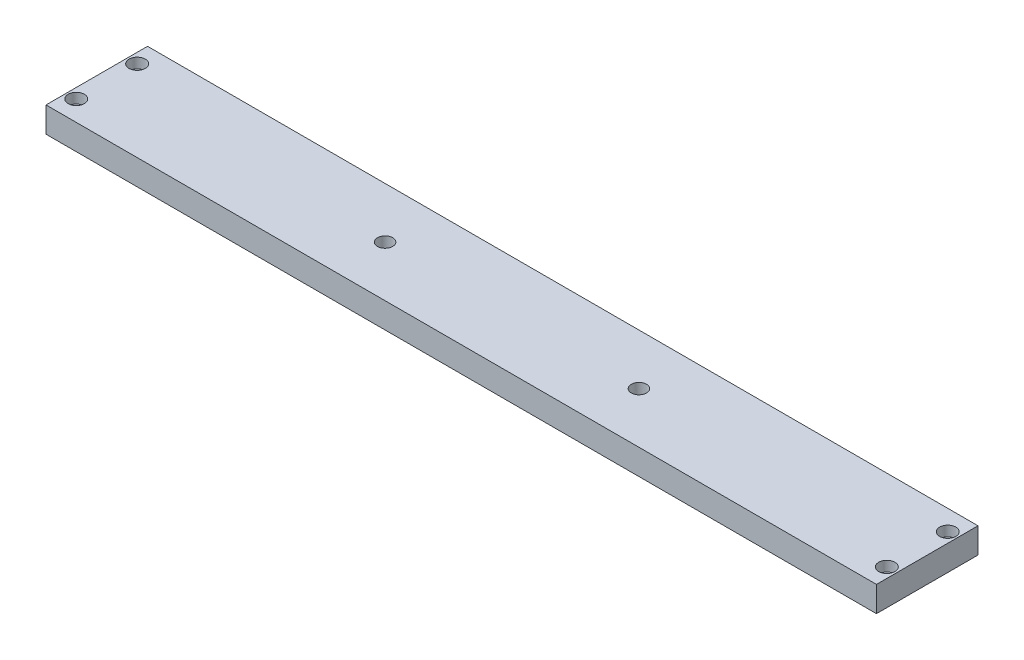
ISO-10303-21;
HEADER;
FILE_DESCRIPTION(('STEP AP214'),'2;1');
FILE_NAME('part.step','',(''),(''),'','','');
FILE_SCHEMA(('AUTOMOTIVE_DESIGN { 1 0 10303 214 1 1 1 1 }'));
ENDSEC;
DATA;
#1=APPLICATION_CONTEXT('core data for automotive mechanical design processes');
#2=APPLICATION_PROTOCOL_DEFINITION('international standard','automotive_design',2000,#1);
#3=PRODUCT_CONTEXT('',#1,'mechanical');
#4=PRODUCT('Part','Part','',(#3));
#5=PRODUCT_RELATED_PRODUCT_CATEGORY('part','',(#4));
#6=PRODUCT_DEFINITION_FORMATION('','',#4);
#7=PRODUCT_DEFINITION_CONTEXT('part definition',#1,'design');
#8=PRODUCT_DEFINITION('design','',#6,#7);
#9=PRODUCT_DEFINITION_SHAPE('','',#8);
#10=(LENGTH_UNIT() NAMED_UNIT(*) SI_UNIT(.MILLI.,.METRE.));
#11=(NAMED_UNIT(*) PLANE_ANGLE_UNIT() SI_UNIT($,.RADIAN.));
#12=(NAMED_UNIT(*) SI_UNIT($,.STERADIAN.) SOLID_ANGLE_UNIT());
#13=UNCERTAINTY_MEASURE_WITH_UNIT(LENGTH_MEASURE(1.E-05),#10,'distance_accuracy_value','');
#14=(GEOMETRIC_REPRESENTATION_CONTEXT(3) GLOBAL_UNCERTAINTY_ASSIGNED_CONTEXT((#13)) GLOBAL_UNIT_ASSIGNED_CONTEXT((#10,
#11,#12)) REPRESENTATION_CONTEXT('',''));
#15=CARTESIAN_POINT('',(0.,0.,0.));
#16=DIRECTION('',(0.,0.,1.));
#17=DIRECTION('',(1.,0.,0.));
#18=AXIS2_PLACEMENT_3D('',#15,#16,#17);
#19=CARTESIAN_POINT('',(-79.825,5.,-6.));
#20=DIRECTION('',(0.,-1.,0.));
#21=DIRECTION('',(0.,0.,-1.));
#22=AXIS2_PLACEMENT_3D('',#19,#20,#21);
#23=CYLINDRICAL_SURFACE('',#22,0.999999999999998);
#24=CARTESIAN_POINT('',(-79.825,0.,-6.));
#25=DIRECTION('',(0.,1.,0.));
#26=DIRECTION('',(0.,0.,1.));
#27=AXIS2_PLACEMENT_3D('',#24,#25,#26);
#28=CIRCLE('',#27,0.999999999999998);
#29=CARTESIAN_POINT('',(-79.825,0.,-5.));
#30=VERTEX_POINT('',#29);
#31=EDGE_CURVE('E104',#30,#30,#28,.T.);
#32=ORIENTED_EDGE('',*,*,#31,.F.);
#33=EDGE_LOOP('',(#32));
#34=FACE_BOUND('',#33,.T.);
#35=CARTESIAN_POINT('',(-79.825,3.,-6.));
#36=DIRECTION('',(0.,1.,0.));
#37=DIRECTION('',(0.,0.,1.));
#38=AXIS2_PLACEMENT_3D('',#35,#36,#37);
#39=CIRCLE('',#38,0.999999999999998);
#40=CARTESIAN_POINT('',(-79.825,3.,-5.));
#41=VERTEX_POINT('',#40);
#42=EDGE_CURVE('E120',#41,#41,#39,.T.);
#43=ORIENTED_EDGE('',*,*,#42,.T.);
#44=EDGE_LOOP('',(#43));
#45=FACE_BOUND('',#44,.T.);
#46=ADVANCED_FACE('F34',(#34,#45),#23,.F.);
#47=CARTESIAN_POINT('',(-79.825,5.,6.));
#48=DIRECTION('',(0.,-1.,0.));
#49=DIRECTION('',(0.,0.,-1.));
#50=AXIS2_PLACEMENT_3D('',#47,#48,#49);
#51=CYLINDRICAL_SURFACE('',#50,0.999999999999998);
#52=CARTESIAN_POINT('',(-79.825,0.,6.));
#53=DIRECTION('',(0.,1.,0.));
#54=DIRECTION('',(0.,0.,1.));
#55=AXIS2_PLACEMENT_3D('',#52,#53,#54);
#56=CIRCLE('',#55,0.999999999999998);
#57=CARTESIAN_POINT('',(-79.825,0.,7.));
#58=VERTEX_POINT('',#57);
#59=EDGE_CURVE('E165',#58,#58,#56,.T.);
#60=ORIENTED_EDGE('',*,*,#59,.F.);
#61=EDGE_LOOP('',(#60));
#62=FACE_BOUND('',#61,.T.);
#63=CARTESIAN_POINT('',(-79.825,3.,6.));
#64=DIRECTION('',(0.,1.,0.));
#65=DIRECTION('',(0.,0.,1.));
#66=AXIS2_PLACEMENT_3D('',#63,#64,#65);
#67=CIRCLE('',#66,0.999999999999998);
#68=CARTESIAN_POINT('',(-79.825,3.,7.));
#69=VERTEX_POINT('',#68);
#70=EDGE_CURVE('E117',#69,#69,#67,.T.);
#71=ORIENTED_EDGE('',*,*,#70,.T.);
#72=EDGE_LOOP('',(#71));
#73=FACE_BOUND('',#72,.T.);
#74=ADVANCED_FACE('F176',(#62,#73),#51,.F.);
#75=CARTESIAN_POINT('',(79.825,5.,-6.));
#76=DIRECTION('',(0.,-1.,0.));
#77=DIRECTION('',(0.,0.,-1.));
#78=AXIS2_PLACEMENT_3D('',#75,#76,#77);
#79=CYLINDRICAL_SURFACE('',#78,0.999999999999998);
#80=CARTESIAN_POINT('',(79.825,0.,-6.));
#81=DIRECTION('',(0.,1.,0.));
#82=DIRECTION('',(0.,0.,1.));
#83=AXIS2_PLACEMENT_3D('',#80,#81,#82);
#84=CIRCLE('',#83,0.999999999999998);
#85=CARTESIAN_POINT('',(79.825,0.,-5.));
#86=VERTEX_POINT('',#85);
#87=EDGE_CURVE('E162',#86,#86,#84,.T.);
#88=ORIENTED_EDGE('',*,*,#87,.F.);
#89=EDGE_LOOP('',(#88));
#90=FACE_BOUND('',#89,.T.);
#91=CARTESIAN_POINT('',(79.825,3.,-6.));
#92=DIRECTION('',(0.,1.,0.));
#93=DIRECTION('',(0.,0.,1.));
#94=AXIS2_PLACEMENT_3D('',#91,#92,#93);
#95=CIRCLE('',#94,0.999999999999998);
#96=CARTESIAN_POINT('',(79.825,3.,-5.));
#97=VERTEX_POINT('',#96);
#98=EDGE_CURVE('E113',#97,#97,#95,.T.);
#99=ORIENTED_EDGE('',*,*,#98,.T.);
#100=EDGE_LOOP('',(#99));
#101=FACE_BOUND('',#100,.T.);
#102=ADVANCED_FACE('F204',(#90,#101),#79,.F.);
#103=CARTESIAN_POINT('',(79.825,5.,6.));
#104=DIRECTION('',(0.,-1.,0.));
#105=DIRECTION('',(0.,0.,-1.));
#106=AXIS2_PLACEMENT_3D('',#103,#104,#105);
#107=CYLINDRICAL_SURFACE('',#106,0.999999999999998);
#108=CARTESIAN_POINT('',(79.825,0.,6.));
#109=DIRECTION('',(0.,1.,0.));
#110=DIRECTION('',(0.,0.,1.));
#111=AXIS2_PLACEMENT_3D('',#108,#109,#110);
#112=CIRCLE('',#111,0.999999999999998);
#113=CARTESIAN_POINT('',(79.825,0.,7.));
#114=VERTEX_POINT('',#113);
#115=EDGE_CURVE('E122',#114,#114,#112,.T.);
#116=ORIENTED_EDGE('',*,*,#115,.F.);
#117=EDGE_LOOP('',(#116));
#118=FACE_BOUND('',#117,.T.);
#119=CARTESIAN_POINT('',(79.825,3.,6.));
#120=DIRECTION('',(0.,1.,0.));
#121=DIRECTION('',(0.,0.,1.));
#122=AXIS2_PLACEMENT_3D('',#119,#120,#121);
#123=CIRCLE('',#122,0.999999999999998);
#124=CARTESIAN_POINT('',(79.825,3.,7.));
#125=VERTEX_POINT('',#124);
#126=EDGE_CURVE('E110',#125,#125,#123,.T.);
#127=ORIENTED_EDGE('',*,*,#126,.T.);
#128=EDGE_LOOP('',(#127));
#129=FACE_BOUND('',#128,.T.);
#130=ADVANCED_FACE('F195',(#118,#129),#107,.F.);
#131=CARTESIAN_POINT('',(0.,5.,0.));
#132=DIRECTION('',(0.,-1.,0.));
#133=DIRECTION('',(0.,0.,-1.));
#134=AXIS2_PLACEMENT_3D('',#131,#132,#133);
#135=PLANE('',#134);
#136=CARTESIAN_POINT('',(-25.,5.,0.));
#137=DIRECTION('',(0.,1.,0.));
#138=DIRECTION('',(0.,0.,1.));
#139=AXIS2_PLACEMENT_3D('',#136,#137,#138);
#140=CIRCLE('',#139,1.5);
#141=CARTESIAN_POINT('',(-25.,5.,1.5));
#142=VERTEX_POINT('',#141);
#143=EDGE_CURVE('E125',#142,#142,#140,.T.);
#144=ORIENTED_EDGE('',*,*,#143,.F.);
#145=EDGE_LOOP('',(#144));
#146=FACE_BOUND('',#145,.T.);
#147=CARTESIAN_POINT('',(25.,5.,0.));
#148=DIRECTION('',(0.,1.,0.));
#149=DIRECTION('',(0.,0.,1.));
#150=AXIS2_PLACEMENT_3D('',#147,#148,#149);
#151=CIRCLE('',#150,1.5);
#152=CARTESIAN_POINT('',(25.,5.,1.5));
#153=VERTEX_POINT('',#152);
#154=EDGE_CURVE('E131',#153,#153,#151,.T.);
#155=ORIENTED_EDGE('',*,*,#154,.F.);
#156=EDGE_LOOP('',(#155));
#157=FACE_BOUND('',#156,.T.);
#158=CARTESIAN_POINT('',(-79.825,5.,6.));
#159=DIRECTION('',(0.,1.,0.));
#160=DIRECTION('',(0.,0.,1.));
#161=AXIS2_PLACEMENT_3D('',#158,#159,#160);
#162=CIRCLE('',#161,1.60000000000001);
#163=CARTESIAN_POINT('',(-79.825,5.,7.60000000000001));
#164=VERTEX_POINT('',#163);
#165=EDGE_CURVE('E148',#164,#164,#162,.T.);
#166=ORIENTED_EDGE('',*,*,#165,.F.);
#167=EDGE_LOOP('',(#166));
#168=FACE_BOUND('',#167,.T.);
#169=CARTESIAN_POINT('',(79.825,5.,-6.));
#170=DIRECTION('',(0.,1.,0.));
#171=DIRECTION('',(0.,0.,1.));
#172=AXIS2_PLACEMENT_3D('',#169,#170,#171);
#173=CIRCLE('',#172,1.60000000000001);
#174=CARTESIAN_POINT('',(79.825,5.,-4.39999999999999));
#175=VERTEX_POINT('',#174);
#176=EDGE_CURVE('E141',#175,#175,#173,.T.);
#177=ORIENTED_EDGE('',*,*,#176,.F.);
#178=EDGE_LOOP('',(#177));
#179=FACE_BOUND('',#178,.T.);
#180=CARTESIAN_POINT('',(79.825,5.,6.));
#181=DIRECTION('',(0.,1.,0.));
#182=DIRECTION('',(0.,0.,1.));
#183=AXIS2_PLACEMENT_3D('',#180,#181,#182);
#184=CIRCLE('',#183,1.60000000000001);
#185=CARTESIAN_POINT('',(79.825,5.,7.60000000000001));
#186=VERTEX_POINT('',#185);
#187=EDGE_CURVE('E129',#186,#186,#184,.T.);
#188=ORIENTED_EDGE('',*,*,#187,.F.);
#189=EDGE_LOOP('',(#188));
#190=FACE_BOUND('',#189,.T.);
#191=CARTESIAN_POINT('',(-79.825,5.,-6.));
#192=DIRECTION('',(0.,1.,0.));
#193=DIRECTION('',(0.,0.,1.));
#194=AXIS2_PLACEMENT_3D('',#191,#192,#193);
#195=CIRCLE('',#194,1.60000000000001);
#196=CARTESIAN_POINT('',(-79.825,5.,-4.39999999999999));
#197=VERTEX_POINT('',#196);
#198=EDGE_CURVE('E147',#197,#197,#195,.T.);
#199=ORIENTED_EDGE('',*,*,#198,.F.);
#200=EDGE_LOOP('',(#199));
#201=FACE_BOUND('',#200,.T.);
#202=DIRECTION('',(0.,0.,-1.));
#203=VECTOR('',#202,1.);
#204=CARTESIAN_POINT('',(81.785,5.,10.));
#205=LINE('',#204,#203);
#206=CARTESIAN_POINT('',(81.785,5.,10.));
#207=VERTEX_POINT('',#206);
#208=CARTESIAN_POINT('',(81.785,5.,-10.));
#209=VERTEX_POINT('',#208);
#210=EDGE_CURVE('E88',#207,#209,#205,.T.);
#211=ORIENTED_EDGE('',*,*,#210,.T.);
#212=DIRECTION('',(-1.,0.,0.));
#213=VECTOR('',#212,1.);
#214=CARTESIAN_POINT('',(-81.785,5.,-10.));
#215=LINE('',#214,#213);
#216=CARTESIAN_POINT('',(-81.785,5.,-10.));
#217=VERTEX_POINT('',#216);
#218=EDGE_CURVE('E83',#209,#217,#215,.T.);
#219=ORIENTED_EDGE('',*,*,#218,.T.);
#220=DIRECTION('',(0.,0.,1.));
#221=VECTOR('',#220,1.);
#222=CARTESIAN_POINT('',(-81.785,5.,10.));
#223=LINE('',#222,#221);
#224=CARTESIAN_POINT('',(-81.785,5.,10.));
#225=VERTEX_POINT('',#224);
#226=EDGE_CURVE('E86',#217,#225,#223,.T.);
#227=ORIENTED_EDGE('',*,*,#226,.T.);
#228=DIRECTION('',(1.,0.,0.));
#229=VECTOR('',#228,1.);
#230=CARTESIAN_POINT('',(-81.785,5.,10.));
#231=LINE('',#230,#229);
#232=EDGE_CURVE('E53',#225,#207,#231,.T.);
#233=ORIENTED_EDGE('',*,*,#232,.T.);
#234=EDGE_LOOP('',(#211,#219,#227,#233));
#235=FACE_BOUND('',#234,.T.);
#236=ADVANCED_FACE('F84',(#146,#157,#168,#179,#190,#201,#235),#135,.F.);
#237=CARTESIAN_POINT('',(0.,0.,0.));
#238=DIRECTION('',(0.,-1.,0.));
#239=DIRECTION('',(0.,0.,-1.));
#240=AXIS2_PLACEMENT_3D('',#237,#238,#239);
#241=PLANE('',#240);
#242=CARTESIAN_POINT('',(-25.,0.,0.));
#243=DIRECTION('',(0.,-1.,0.));
#244=DIRECTION('',(0.,0.,-1.));
#245=AXIS2_PLACEMENT_3D('',#242,#243,#244);
#246=CIRCLE('',#245,1.5);
#247=CARTESIAN_POINT('',(-25.,0.,-1.5));
#248=VERTEX_POINT('',#247);
#249=EDGE_CURVE('E38',#248,#248,#246,.T.);
#250=ORIENTED_EDGE('',*,*,#249,.F.);
#251=EDGE_LOOP('',(#250));
#252=FACE_BOUND('',#251,.T.);
#253=CARTESIAN_POINT('',(25.,0.,0.));
#254=DIRECTION('',(0.,-1.,0.));
#255=DIRECTION('',(0.,0.,-1.));
#256=AXIS2_PLACEMENT_3D('',#253,#254,#255);
#257=CIRCLE('',#256,1.5);
#258=CARTESIAN_POINT('',(25.,0.,-1.5));
#259=VERTEX_POINT('',#258);
#260=EDGE_CURVE('E123',#259,#259,#257,.T.);
#261=ORIENTED_EDGE('',*,*,#260,.F.);
#262=EDGE_LOOP('',(#261));
#263=FACE_BOUND('',#262,.T.);
#264=ORIENTED_EDGE('',*,*,#87,.T.);
#265=EDGE_LOOP('',(#264));
#266=FACE_BOUND('',#265,.T.);
#267=ORIENTED_EDGE('',*,*,#31,.T.);
#268=EDGE_LOOP('',(#267));
#269=FACE_BOUND('',#268,.T.);
#270=DIRECTION('',(0.,0.,-1.));
#271=VECTOR('',#270,1.);
#272=CARTESIAN_POINT('',(81.785,0.,10.));
#273=LINE('',#272,#271);
#274=CARTESIAN_POINT('',(81.785,0.,10.));
#275=VERTEX_POINT('',#274);
#276=CARTESIAN_POINT('',(81.785,0.,-10.));
#277=VERTEX_POINT('',#276);
#278=EDGE_CURVE('E101',#275,#277,#273,.T.);
#279=ORIENTED_EDGE('',*,*,#278,.F.);
#280=DIRECTION('',(1.,0.,0.));
#281=VECTOR('',#280,1.);
#282=CARTESIAN_POINT('',(-81.785,0.,10.));
#283=LINE('',#282,#281);
#284=CARTESIAN_POINT('',(-81.785,0.,10.));
#285=VERTEX_POINT('',#284);
#286=EDGE_CURVE('E76',#285,#275,#283,.T.);
#287=ORIENTED_EDGE('',*,*,#286,.F.);
#288=DIRECTION('',(0.,0.,1.));
#289=VECTOR('',#288,1.);
#290=CARTESIAN_POINT('',(-81.785,0.,10.));
#291=LINE('',#290,#289);
#292=CARTESIAN_POINT('',(-81.785,0.,-10.));
#293=VERTEX_POINT('',#292);
#294=EDGE_CURVE('E70',#293,#285,#291,.T.);
#295=ORIENTED_EDGE('',*,*,#294,.F.);
#296=DIRECTION('',(-1.,0.,0.));
#297=VECTOR('',#296,1.);
#298=CARTESIAN_POINT('',(-81.785,0.,-10.));
#299=LINE('',#298,#297);
#300=EDGE_CURVE('E92',#277,#293,#299,.T.);
#301=ORIENTED_EDGE('',*,*,#300,.F.);
#302=EDGE_LOOP('',(#279,#287,#295,#301));
#303=FACE_BOUND('',#302,.T.);
#304=ORIENTED_EDGE('',*,*,#59,.T.);
#305=EDGE_LOOP('',(#304));
#306=FACE_BOUND('',#305,.T.);
#307=ORIENTED_EDGE('',*,*,#115,.T.);
#308=EDGE_LOOP('',(#307));
#309=FACE_BOUND('',#308,.T.);
#310=ADVANCED_FACE('F171',(#252,#263,#266,#269,#303,#306,#309),#241,.T.);
#311=CARTESIAN_POINT('',(81.785,5.,10.));
#312=DIRECTION('',(-1.,0.,0.));
#313=DIRECTION('',(0.,0.,1.));
#314=AXIS2_PLACEMENT_3D('',#311,#312,#313);
#315=PLANE('',#314);
#316=ORIENTED_EDGE('',*,*,#278,.T.);
#317=DIRECTION('',(0.,-1.,0.));
#318=VECTOR('',#317,1.);
#319=CARTESIAN_POINT('',(81.785,5.,-10.));
#320=LINE('',#319,#318);
#321=EDGE_CURVE('E11',#209,#277,#320,.T.);
#322=ORIENTED_EDGE('',*,*,#321,.F.);
#323=ORIENTED_EDGE('',*,*,#210,.F.);
#324=DIRECTION('',(0.,-1.,0.));
#325=VECTOR('',#324,1.);
#326=CARTESIAN_POINT('',(81.785,5.,10.));
#327=LINE('',#326,#325);
#328=EDGE_CURVE('E97',#207,#275,#327,.T.);
#329=ORIENTED_EDGE('',*,*,#328,.T.);
#330=EDGE_LOOP('',(#316,#322,#323,#329));
#331=FACE_BOUND('',#330,.T.);
#332=ADVANCED_FACE('F36',(#331),#315,.F.);
#333=CARTESIAN_POINT('',(-81.785,5.,-10.));
#334=DIRECTION('',(0.,0.,1.));
#335=DIRECTION('',(1.,0.,0.));
#336=AXIS2_PLACEMENT_3D('',#333,#334,#335);
#337=PLANE('',#336);
#338=ORIENTED_EDGE('',*,*,#300,.T.);
#339=DIRECTION('',(0.,-1.,0.));
#340=VECTOR('',#339,1.);
#341=CARTESIAN_POINT('',(-81.785,5.,-10.));
#342=LINE('',#341,#340);
#343=EDGE_CURVE('E44',#217,#293,#342,.T.);
#344=ORIENTED_EDGE('',*,*,#343,.F.);
#345=ORIENTED_EDGE('',*,*,#218,.F.);
#346=ORIENTED_EDGE('',*,*,#321,.T.);
#347=EDGE_LOOP('',(#338,#344,#345,#346));
#348=FACE_BOUND('',#347,.T.);
#349=ADVANCED_FACE('F91',(#348),#337,.F.);
#350=CARTESIAN_POINT('',(-81.785,5.,10.));
#351=DIRECTION('',(1.,0.,0.));
#352=DIRECTION('',(0.,0.,-1.));
#353=AXIS2_PLACEMENT_3D('',#350,#351,#352);
#354=PLANE('',#353);
#355=ORIENTED_EDGE('',*,*,#294,.T.);
#356=DIRECTION('',(0.,-1.,0.));
#357=VECTOR('',#356,1.);
#358=CARTESIAN_POINT('',(-81.785,5.,10.));
#359=LINE('',#358,#357);
#360=EDGE_CURVE('E93',#225,#285,#359,.T.);
#361=ORIENTED_EDGE('',*,*,#360,.F.);
#362=ORIENTED_EDGE('',*,*,#226,.F.);
#363=ORIENTED_EDGE('',*,*,#343,.T.);
#364=EDGE_LOOP('',(#355,#361,#362,#363));
#365=FACE_BOUND('',#364,.T.);
#366=ADVANCED_FACE('F95',(#365),#354,.F.);
#367=CARTESIAN_POINT('',(-81.785,5.,10.));
#368=DIRECTION('',(0.,0.,-1.));
#369=DIRECTION('',(-1.,0.,0.));
#370=AXIS2_PLACEMENT_3D('',#367,#368,#369);
#371=PLANE('',#370);
#372=ORIENTED_EDGE('',*,*,#286,.T.);
#373=ORIENTED_EDGE('',*,*,#328,.F.);
#374=ORIENTED_EDGE('',*,*,#232,.F.);
#375=ORIENTED_EDGE('',*,*,#360,.T.);
#376=EDGE_LOOP('',(#372,#373,#374,#375));
#377=FACE_BOUND('',#376,.T.);
#378=ADVANCED_FACE('F210',(#377),#371,.F.);
#379=CARTESIAN_POINT('',(79.825,3.,6.));
#380=DIRECTION('',(0.,1.,0.));
#381=DIRECTION('',(0.,0.,1.));
#382=AXIS2_PLACEMENT_3D('',#379,#380,#381);
#383=CYLINDRICAL_SURFACE('',#382,1.60000000000001);
#384=CARTESIAN_POINT('',(79.825,3.,6.));
#385=DIRECTION('',(0.,1.,0.));
#386=DIRECTION('',(0.,0.,1.));
#387=AXIS2_PLACEMENT_3D('',#384,#385,#386);
#388=CIRCLE('',#387,1.60000000000001);
#389=CARTESIAN_POINT('',(79.825,3.,7.60000000000001));
#390=VERTEX_POINT('',#389);
#391=EDGE_CURVE('E138',#390,#390,#388,.T.);
#392=ORIENTED_EDGE('',*,*,#391,.F.);
#393=EDGE_LOOP('',(#392));
#394=FACE_BOUND('',#393,.T.);
#395=ORIENTED_EDGE('',*,*,#187,.T.);
#396=EDGE_LOOP('',(#395));
#397=FACE_BOUND('',#396,.T.);
#398=ADVANCED_FACE('F213',(#394,#397),#383,.F.);
#399=CARTESIAN_POINT('',(79.825,3.,6.));
#400=DIRECTION('',(0.,1.,0.));
#401=DIRECTION('',(0.,0.,1.));
#402=AXIS2_PLACEMENT_3D('',#399,#400,#401);
#403=PLANE('',#402);
#404=ORIENTED_EDGE('',*,*,#126,.F.);
#405=EDGE_LOOP('',(#404));
#406=FACE_BOUND('',#405,.T.);
#407=ORIENTED_EDGE('',*,*,#391,.T.);
#408=EDGE_LOOP('',(#407));
#409=FACE_BOUND('',#408,.T.);
#410=ADVANCED_FACE('F230',(#406,#409),#403,.T.);
#411=CARTESIAN_POINT('',(79.825,3.,-6.));
#412=DIRECTION('',(0.,1.,0.));
#413=DIRECTION('',(0.,0.,1.));
#414=AXIS2_PLACEMENT_3D('',#411,#412,#413);
#415=CYLINDRICAL_SURFACE('',#414,1.60000000000001);
#416=CARTESIAN_POINT('',(79.825,3.,-6.));
#417=DIRECTION('',(0.,1.,0.));
#418=DIRECTION('',(0.,0.,1.));
#419=AXIS2_PLACEMENT_3D('',#416,#417,#418);
#420=CIRCLE('',#419,1.60000000000001);
#421=CARTESIAN_POINT('',(79.825,3.,-4.39999999999999));
#422=VERTEX_POINT('',#421);
#423=EDGE_CURVE('E151',#422,#422,#420,.T.);
#424=ORIENTED_EDGE('',*,*,#423,.F.);
#425=EDGE_LOOP('',(#424));
#426=FACE_BOUND('',#425,.T.);
#427=ORIENTED_EDGE('',*,*,#176,.T.);
#428=EDGE_LOOP('',(#427));
#429=FACE_BOUND('',#428,.T.);
#430=ADVANCED_FACE('F233',(#426,#429),#415,.F.);
#431=CARTESIAN_POINT('',(79.825,3.,-6.));
#432=DIRECTION('',(0.,1.,0.));
#433=DIRECTION('',(0.,0.,1.));
#434=AXIS2_PLACEMENT_3D('',#431,#432,#433);
#435=PLANE('',#434);
#436=ORIENTED_EDGE('',*,*,#98,.F.);
#437=EDGE_LOOP('',(#436));
#438=FACE_BOUND('',#437,.T.);
#439=ORIENTED_EDGE('',*,*,#423,.T.);
#440=EDGE_LOOP('',(#439));
#441=FACE_BOUND('',#440,.T.);
#442=ADVANCED_FACE('F252',(#438,#441),#435,.T.);
#443=CARTESIAN_POINT('',(-79.825,3.,6.));
#444=DIRECTION('',(0.,1.,0.));
#445=DIRECTION('',(0.,0.,1.));
#446=AXIS2_PLACEMENT_3D('',#443,#444,#445);
#447=CYLINDRICAL_SURFACE('',#446,1.60000000000001);
#448=CARTESIAN_POINT('',(-79.825,3.,6.));
#449=DIRECTION('',(0.,1.,0.));
#450=DIRECTION('',(0.,0.,1.));
#451=AXIS2_PLACEMENT_3D('',#448,#449,#450);
#452=CIRCLE('',#451,1.60000000000001);
#453=CARTESIAN_POINT('',(-79.825,3.,7.60000000000001));
#454=VERTEX_POINT('',#453);
#455=EDGE_CURVE('E144',#454,#454,#452,.T.);
#456=ORIENTED_EDGE('',*,*,#455,.F.);
#457=EDGE_LOOP('',(#456));
#458=FACE_BOUND('',#457,.T.);
#459=ORIENTED_EDGE('',*,*,#165,.T.);
#460=EDGE_LOOP('',(#459));
#461=FACE_BOUND('',#460,.T.);
#462=ADVANCED_FACE('F248',(#458,#461),#447,.F.);
#463=CARTESIAN_POINT('',(-79.825,3.,6.));
#464=DIRECTION('',(0.,1.,0.));
#465=DIRECTION('',(0.,0.,1.));
#466=AXIS2_PLACEMENT_3D('',#463,#464,#465);
#467=PLANE('',#466);
#468=ORIENTED_EDGE('',*,*,#70,.F.);
#469=EDGE_LOOP('',(#468));
#470=FACE_BOUND('',#469,.T.);
#471=ORIENTED_EDGE('',*,*,#455,.T.);
#472=EDGE_LOOP('',(#471));
#473=FACE_BOUND('',#472,.T.);
#474=ADVANCED_FACE('F190',(#470,#473),#467,.T.);
#475=CARTESIAN_POINT('',(-79.825,3.,-6.));
#476=DIRECTION('',(0.,1.,0.));
#477=DIRECTION('',(0.,0.,1.));
#478=AXIS2_PLACEMENT_3D('',#475,#476,#477);
#479=CYLINDRICAL_SURFACE('',#478,1.60000000000001);
#480=CARTESIAN_POINT('',(-79.825,3.,-6.));
#481=DIRECTION('',(0.,1.,0.));
#482=DIRECTION('',(0.,0.,1.));
#483=AXIS2_PLACEMENT_3D('',#480,#481,#482);
#484=CIRCLE('',#483,1.60000000000001);
#485=CARTESIAN_POINT('',(-79.825,3.,-4.39999999999999));
#486=VERTEX_POINT('',#485);
#487=EDGE_CURVE('E114',#486,#486,#484,.T.);
#488=ORIENTED_EDGE('',*,*,#487,.F.);
#489=EDGE_LOOP('',(#488));
#490=FACE_BOUND('',#489,.T.);
#491=ORIENTED_EDGE('',*,*,#198,.T.);
#492=EDGE_LOOP('',(#491));
#493=FACE_BOUND('',#492,.T.);
#494=ADVANCED_FACE('F184',(#490,#493),#479,.F.);
#495=CARTESIAN_POINT('',(-79.825,3.,-6.));
#496=DIRECTION('',(0.,1.,0.));
#497=DIRECTION('',(0.,0.,1.));
#498=AXIS2_PLACEMENT_3D('',#495,#496,#497);
#499=PLANE('',#498);
#500=ORIENTED_EDGE('',*,*,#42,.F.);
#501=EDGE_LOOP('',(#500));
#502=FACE_BOUND('',#501,.T.);
#503=ORIENTED_EDGE('',*,*,#487,.T.);
#504=EDGE_LOOP('',(#503));
#505=FACE_BOUND('',#504,.T.);
#506=ADVANCED_FACE('F180',(#502,#505),#499,.T.);
#507=CARTESIAN_POINT('',(25.,-5.,0.));
#508=DIRECTION('',(0.,1.,0.));
#509=DIRECTION('',(0.,0.,1.));
#510=AXIS2_PLACEMENT_3D('',#507,#508,#509);
#511=CYLINDRICAL_SURFACE('',#510,1.5);
#512=ORIENTED_EDGE('',*,*,#260,.T.);
#513=EDGE_LOOP('',(#512));
#514=FACE_BOUND('',#513,.T.);
#515=ORIENTED_EDGE('',*,*,#154,.T.);
#516=EDGE_LOOP('',(#515));
#517=FACE_BOUND('',#516,.T.);
#518=ADVANCED_FACE('F183',(#514,#517),#511,.F.);
#519=CARTESIAN_POINT('',(-25.,-5.,0.));
#520=DIRECTION('',(0.,1.,0.));
#521=DIRECTION('',(0.,0.,1.));
#522=AXIS2_PLACEMENT_3D('',#519,#520,#521);
#523=CYLINDRICAL_SURFACE('',#522,1.5);
#524=ORIENTED_EDGE('',*,*,#249,.T.);
#525=EDGE_LOOP('',(#524));
#526=FACE_BOUND('',#525,.T.);
#527=ORIENTED_EDGE('',*,*,#143,.T.);
#528=EDGE_LOOP('',(#527));
#529=FACE_BOUND('',#528,.T.);
#530=ADVANCED_FACE('F354',(#526,#529),#523,.F.);
#531=CLOSED_SHELL('',(#46,#74,#102,#130,#236,#310,#332,#349,#366,#378,#398,#410,#430,#442,#462,
#474,#494,#506,#518,#530));
#532=MANIFOLD_SOLID_BREP('B2',#531);
#533=ADVANCED_BREP_SHAPE_REPRESENTATION('',(#18,#532),#14);
#534=SHAPE_DEFINITION_REPRESENTATION(#9,#533);
ENDSEC;
END-ISO-10303-21;
